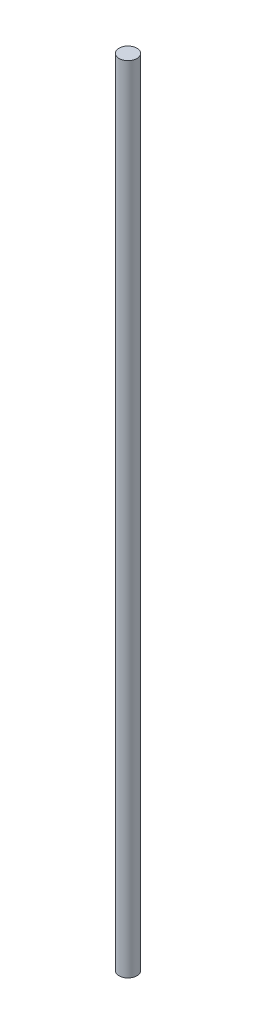
ISO-10303-21;
HEADER;
FILE_DESCRIPTION(('STEP AP214'),'2;1');
FILE_NAME('part.step','',(''),(''),'','','');
FILE_SCHEMA(('AUTOMOTIVE_DESIGN { 1 0 10303 214 1 1 1 1 }'));
ENDSEC;
DATA;
#1=APPLICATION_CONTEXT('core data for automotive mechanical design processes');
#2=APPLICATION_PROTOCOL_DEFINITION('international standard','automotive_design',2000,#1);
#3=PRODUCT_CONTEXT('',#1,'mechanical');
#4=PRODUCT('Part','Part','',(#3));
#5=PRODUCT_RELATED_PRODUCT_CATEGORY('part','',(#4));
#6=PRODUCT_DEFINITION_FORMATION('','',#4);
#7=PRODUCT_DEFINITION_CONTEXT('part definition',#1,'design');
#8=PRODUCT_DEFINITION('design','',#6,#7);
#9=PRODUCT_DEFINITION_SHAPE('','',#8);
#10=(LENGTH_UNIT() NAMED_UNIT(*) SI_UNIT(.MILLI.,.METRE.));
#11=(NAMED_UNIT(*) PLANE_ANGLE_UNIT() SI_UNIT($,.RADIAN.));
#12=(NAMED_UNIT(*) SI_UNIT($,.STERADIAN.) SOLID_ANGLE_UNIT());
#13=UNCERTAINTY_MEASURE_WITH_UNIT(LENGTH_MEASURE(1.E-05),#10,'distance_accuracy_value','');
#14=(GEOMETRIC_REPRESENTATION_CONTEXT(3) GLOBAL_UNCERTAINTY_ASSIGNED_CONTEXT((#13)) GLOBAL_UNIT_ASSIGNED_CONTEXT((#10,
#11,#12)) REPRESENTATION_CONTEXT('',''));
#15=CARTESIAN_POINT('',(0.,0.,0.));
#16=DIRECTION('',(0.,0.,1.));
#17=DIRECTION('',(1.,0.,0.));
#18=AXIS2_PLACEMENT_3D('',#15,#16,#17);
#19=CARTESIAN_POINT('',(0.,270.,0.));
#20=DIRECTION('',(0.,-1.,0.));
#21=DIRECTION('',(0.,0.,-1.));
#22=AXIS2_PLACEMENT_3D('',#19,#20,#21);
#23=CYLINDRICAL_SURFACE('',#22,3.05);
#24=CARTESIAN_POINT('',(0.,270.,0.));
#25=DIRECTION('',(0.,1.,0.));
#26=DIRECTION('',(0.,0.,1.));
#27=AXIS2_PLACEMENT_3D('',#24,#25,#26);
#28=CIRCLE('',#27,3.05);
#29=CARTESIAN_POINT('',(0.,270.,3.05));
#30=VERTEX_POINT('',#29);
#31=EDGE_CURVE('E10',#30,#30,#28,.T.);
#32=ORIENTED_EDGE('',*,*,#31,.F.);
#33=EDGE_LOOP('',(#32));
#34=FACE_BOUND('',#33,.T.);
#35=CARTESIAN_POINT('',(0.,0.,0.));
#36=DIRECTION('',(0.,1.,0.));
#37=DIRECTION('',(0.,0.,1.));
#38=AXIS2_PLACEMENT_3D('',#35,#36,#37);
#39=CIRCLE('',#38,3.05);
#40=CARTESIAN_POINT('',(0.,0.,3.05));
#41=VERTEX_POINT('',#40);
#42=EDGE_CURVE('E34',#41,#41,#39,.T.);
#43=ORIENTED_EDGE('',*,*,#42,.T.);
#44=EDGE_LOOP('',(#43));
#45=FACE_BOUND('',#44,.T.);
#46=ADVANCED_FACE('F31',(#34,#45),#23,.T.);
#47=CARTESIAN_POINT('',(0.,270.,0.));
#48=DIRECTION('',(0.,1.,0.));
#49=DIRECTION('',(0.,0.,1.));
#50=AXIS2_PLACEMENT_3D('',#47,#48,#49);
#51=PLANE('',#50);
#52=ORIENTED_EDGE('',*,*,#31,.T.);
#53=EDGE_LOOP('',(#52));
#54=FACE_BOUND('',#53,.T.);
#55=ADVANCED_FACE('F46',(#54),#51,.T.);
#56=CARTESIAN_POINT('',(0.,0.,0.));
#57=DIRECTION('',(0.,1.,0.));
#58=DIRECTION('',(0.,0.,1.));
#59=AXIS2_PLACEMENT_3D('',#56,#57,#58);
#60=PLANE('',#59);
#61=ORIENTED_EDGE('',*,*,#42,.F.);
#62=EDGE_LOOP('',(#61));
#63=FACE_BOUND('',#62,.T.);
#64=ADVANCED_FACE('F44',(#63),#60,.F.);
#65=CLOSED_SHELL('',(#46,#55,#64));
#66=MANIFOLD_SOLID_BREP('B2',#65);
#67=ADVANCED_BREP_SHAPE_REPRESENTATION('',(#18,#66),#14);
#68=SHAPE_DEFINITION_REPRESENTATION(#9,#67);
ENDSEC;
END-ISO-10303-21;
